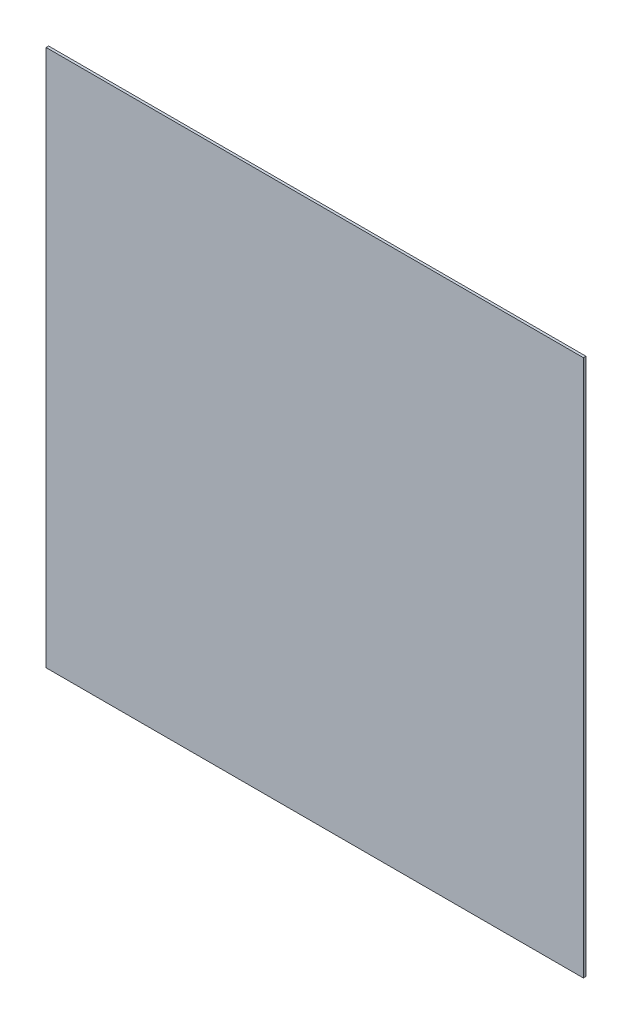
ISO-10303-21;
HEADER;
FILE_DESCRIPTION(('STEP AP214'),'2;1');
FILE_NAME('part.step','',(''),(''),'','','');
FILE_SCHEMA(('AUTOMOTIVE_DESIGN { 1 0 10303 214 1 1 1 1 }'));
ENDSEC;
DATA;
#1=APPLICATION_CONTEXT('core data for automotive mechanical design processes');
#2=APPLICATION_PROTOCOL_DEFINITION('international standard','automotive_design',2000,#1);
#3=PRODUCT_CONTEXT('',#1,'mechanical');
#4=PRODUCT('Part','Part','',(#3));
#5=PRODUCT_RELATED_PRODUCT_CATEGORY('part','',(#4));
#6=PRODUCT_DEFINITION_FORMATION('','',#4);
#7=PRODUCT_DEFINITION_CONTEXT('part definition',#1,'design');
#8=PRODUCT_DEFINITION('design','',#6,#7);
#9=PRODUCT_DEFINITION_SHAPE('','',#8);
#10=(LENGTH_UNIT() NAMED_UNIT(*) SI_UNIT(.MILLI.,.METRE.));
#11=(NAMED_UNIT(*) PLANE_ANGLE_UNIT() SI_UNIT($,.RADIAN.));
#12=(NAMED_UNIT(*) SI_UNIT($,.STERADIAN.) SOLID_ANGLE_UNIT());
#13=UNCERTAINTY_MEASURE_WITH_UNIT(LENGTH_MEASURE(1.E-05),#10,'distance_accuracy_value','');
#14=(GEOMETRIC_REPRESENTATION_CONTEXT(3) GLOBAL_UNCERTAINTY_ASSIGNED_CONTEXT((#13)) GLOBAL_UNIT_ASSIGNED_CONTEXT((#10,
#11,#12)) REPRESENTATION_CONTEXT('',''));
#15=CARTESIAN_POINT('',(0.,0.,0.));
#16=DIRECTION('',(0.,0.,1.));
#17=DIRECTION('',(1.,0.,0.));
#18=AXIS2_PLACEMENT_3D('',#15,#16,#17);
#19=CARTESIAN_POINT('',(0.,0.,3.));
#20=DIRECTION('',(1.,0.,0.));
#21=DIRECTION('',(0.,1.,0.));
#22=AXIS2_PLACEMENT_3D('',#19,#20,#21);
#23=PLANE('',#22);
#24=DIRECTION('',(0.,-1.,0.));
#25=VECTOR('',#24,1.);
#26=CARTESIAN_POINT('',(0.,0.,0.));
#27=LINE('',#26,#25);
#28=CARTESIAN_POINT('',(0.,0.,0.));
#29=VERTEX_POINT('',#28);
#30=CARTESIAN_POINT('',(0.,-635.,0.));
#31=VERTEX_POINT('',#30);
#32=EDGE_CURVE('E96',#29,#31,#27,.T.);
#33=ORIENTED_EDGE('',*,*,#32,.T.);
#34=DIRECTION('',(0.,0.,-1.));
#35=VECTOR('',#34,1.);
#36=CARTESIAN_POINT('',(0.,-635.,3.));
#37=LINE('',#36,#35);
#38=CARTESIAN_POINT('',(0.,-635.,3.));
#39=VERTEX_POINT('',#38);
#40=EDGE_CURVE('E11',#39,#31,#37,.T.);
#41=ORIENTED_EDGE('',*,*,#40,.F.);
#42=DIRECTION('',(0.,-1.,0.));
#43=VECTOR('',#42,1.);
#44=CARTESIAN_POINT('',(0.,0.,3.));
#45=LINE('',#44,#43);
#46=CARTESIAN_POINT('',(0.,0.,3.));
#47=VERTEX_POINT('',#46);
#48=EDGE_CURVE('E84',#47,#39,#45,.T.);
#49=ORIENTED_EDGE('',*,*,#48,.F.);
#50=DIRECTION('',(0.,0.,-1.));
#51=VECTOR('',#50,1.);
#52=CARTESIAN_POINT('',(0.,0.,3.));
#53=LINE('',#52,#51);
#54=EDGE_CURVE('E92',#47,#29,#53,.T.);
#55=ORIENTED_EDGE('',*,*,#54,.T.);
#56=EDGE_LOOP('',(#33,#41,#49,#55));
#57=FACE_BOUND('',#56,.T.);
#58=ADVANCED_FACE('F33',(#57),#23,.F.);
#59=CARTESIAN_POINT('',(0.,-635.,3.));
#60=DIRECTION('',(0.,1.,0.));
#61=DIRECTION('',(0.,0.,1.));
#62=AXIS2_PLACEMENT_3D('',#59,#60,#61);
#63=PLANE('',#62);
#64=DIRECTION('',(1.,0.,0.));
#65=VECTOR('',#64,1.);
#66=CARTESIAN_POINT('',(0.,-635.,0.));
#67=LINE('',#66,#65);
#68=CARTESIAN_POINT('',(635.,-635.,0.));
#69=VERTEX_POINT('',#68);
#70=EDGE_CURVE('E88',#31,#69,#67,.T.);
#71=ORIENTED_EDGE('',*,*,#70,.T.);
#72=DIRECTION('',(0.,0.,-1.));
#73=VECTOR('',#72,1.);
#74=CARTESIAN_POINT('',(635.,-635.,3.));
#75=LINE('',#74,#73);
#76=CARTESIAN_POINT('',(635.,-635.,3.));
#77=VERTEX_POINT('',#76);
#78=EDGE_CURVE('E41',#77,#69,#75,.T.);
#79=ORIENTED_EDGE('',*,*,#78,.F.);
#80=DIRECTION('',(1.,0.,0.));
#81=VECTOR('',#80,1.);
#82=CARTESIAN_POINT('',(0.,-635.,3.));
#83=LINE('',#82,#81);
#84=EDGE_CURVE('E79',#39,#77,#83,.T.);
#85=ORIENTED_EDGE('',*,*,#84,.F.);
#86=ORIENTED_EDGE('',*,*,#40,.T.);
#87=EDGE_LOOP('',(#71,#79,#85,#86));
#88=FACE_BOUND('',#87,.T.);
#89=ADVANCED_FACE('F87',(#88),#63,.F.);
#90=CARTESIAN_POINT('',(635.,0.,3.));
#91=DIRECTION('',(-1.,0.,0.));
#92=DIRECTION('',(0.,-1.,0.));
#93=AXIS2_PLACEMENT_3D('',#90,#91,#92);
#94=PLANE('',#93);
#95=DIRECTION('',(0.,1.,0.));
#96=VECTOR('',#95,1.);
#97=CARTESIAN_POINT('',(635.,0.,0.));
#98=LINE('',#97,#96);
#99=CARTESIAN_POINT('',(635.,0.,0.));
#100=VERTEX_POINT('',#99);
#101=EDGE_CURVE('E66',#69,#100,#98,.T.);
#102=ORIENTED_EDGE('',*,*,#101,.T.);
#103=DIRECTION('',(0.,0.,-1.));
#104=VECTOR('',#103,1.);
#105=CARTESIAN_POINT('',(635.,0.,3.));
#106=LINE('',#105,#104);
#107=CARTESIAN_POINT('',(635.,0.,3.));
#108=VERTEX_POINT('',#107);
#109=EDGE_CURVE('E89',#108,#100,#106,.T.);
#110=ORIENTED_EDGE('',*,*,#109,.F.);
#111=DIRECTION('',(0.,1.,0.));
#112=VECTOR('',#111,1.);
#113=CARTESIAN_POINT('',(635.,0.,3.));
#114=LINE('',#113,#112);
#115=EDGE_CURVE('E82',#77,#108,#114,.T.);
#116=ORIENTED_EDGE('',*,*,#115,.F.);
#117=ORIENTED_EDGE('',*,*,#78,.T.);
#118=EDGE_LOOP('',(#102,#110,#116,#117));
#119=FACE_BOUND('',#118,.T.);
#120=ADVANCED_FACE('F90',(#119),#94,.F.);
#121=CARTESIAN_POINT('',(0.,0.,3.));
#122=DIRECTION('',(0.,-1.,0.));
#123=DIRECTION('',(0.,0.,-1.));
#124=AXIS2_PLACEMENT_3D('',#121,#122,#123);
#125=PLANE('',#124);
#126=DIRECTION('',(-1.,0.,0.));
#127=VECTOR('',#126,1.);
#128=CARTESIAN_POINT('',(0.,0.,0.));
#129=LINE('',#128,#127);
#130=EDGE_CURVE('E72',#100,#29,#129,.T.);
#131=ORIENTED_EDGE('',*,*,#130,.T.);
#132=ORIENTED_EDGE('',*,*,#54,.F.);
#133=DIRECTION('',(-1.,0.,0.));
#134=VECTOR('',#133,1.);
#135=CARTESIAN_POINT('',(0.,0.,3.));
#136=LINE('',#135,#134);
#137=EDGE_CURVE('E49',#108,#47,#136,.T.);
#138=ORIENTED_EDGE('',*,*,#137,.F.);
#139=ORIENTED_EDGE('',*,*,#109,.T.);
#140=EDGE_LOOP('',(#131,#132,#138,#139));
#141=FACE_BOUND('',#140,.T.);
#142=ADVANCED_FACE('F103',(#141),#125,.F.);
#143=CARTESIAN_POINT('',(0.,0.,3.));
#144=DIRECTION('',(0.,0.,1.));
#145=DIRECTION('',(1.,0.,0.));
#146=AXIS2_PLACEMENT_3D('',#143,#144,#145);
#147=PLANE('',#146);
#148=ORIENTED_EDGE('',*,*,#48,.T.);
#149=ORIENTED_EDGE('',*,*,#84,.T.);
#150=ORIENTED_EDGE('',*,*,#115,.T.);
#151=ORIENTED_EDGE('',*,*,#137,.T.);
#152=EDGE_LOOP('',(#148,#149,#150,#151));
#153=FACE_BOUND('',#152,.T.);
#154=ADVANCED_FACE('F80',(#153),#147,.T.);
#155=CARTESIAN_POINT('',(0.,0.,0.));
#156=DIRECTION('',(0.,0.,1.));
#157=DIRECTION('',(1.,0.,0.));
#158=AXIS2_PLACEMENT_3D('',#155,#156,#157);
#159=PLANE('',#158);
#160=ORIENTED_EDGE('',*,*,#32,.F.);
#161=ORIENTED_EDGE('',*,*,#130,.F.);
#162=ORIENTED_EDGE('',*,*,#101,.F.);
#163=ORIENTED_EDGE('',*,*,#70,.F.);
#164=EDGE_LOOP('',(#160,#161,#162,#163));
#165=FACE_BOUND('',#164,.T.);
#166=ADVANCED_FACE('F106',(#165),#159,.F.);
#167=CLOSED_SHELL('',(#58,#89,#120,#142,#154,#166));
#168=MANIFOLD_SOLID_BREP('B2',#167);
#169=ADVANCED_BREP_SHAPE_REPRESENTATION('',(#18,#168),#14);
#170=SHAPE_DEFINITION_REPRESENTATION(#9,#169);
ENDSEC;
END-ISO-10303-21;
